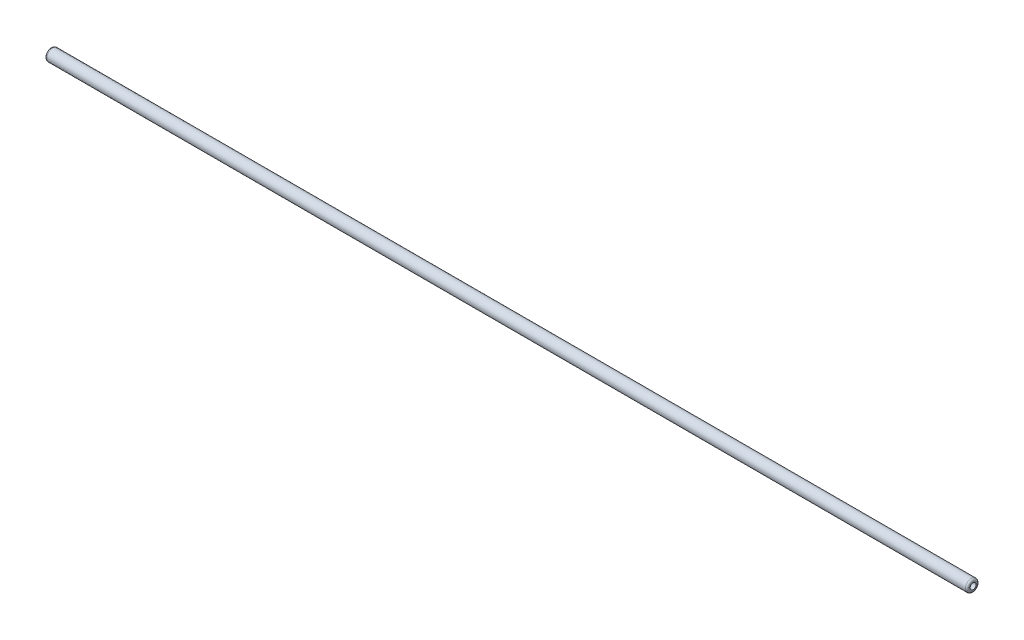
ISO-10303-21;
HEADER;
FILE_DESCRIPTION(('STEP AP214'),'2;1');
FILE_NAME('part.step','',(''),(''),'','','');
FILE_SCHEMA(('AUTOMOTIVE_DESIGN { 1 0 10303 214 1 1 1 1 }'));
ENDSEC;
DATA;
#1=APPLICATION_CONTEXT('core data for automotive mechanical design processes');
#2=APPLICATION_PROTOCOL_DEFINITION('international standard','automotive_design',2000,#1);
#3=PRODUCT_CONTEXT('',#1,'mechanical');
#4=PRODUCT('Part','Part','',(#3));
#5=PRODUCT_RELATED_PRODUCT_CATEGORY('part','',(#4));
#6=PRODUCT_DEFINITION_FORMATION('','',#4);
#7=PRODUCT_DEFINITION_CONTEXT('part definition',#1,'design');
#8=PRODUCT_DEFINITION('design','',#6,#7);
#9=PRODUCT_DEFINITION_SHAPE('','',#8);
#10=(LENGTH_UNIT() NAMED_UNIT(*) SI_UNIT(.MILLI.,.METRE.));
#11=(NAMED_UNIT(*) PLANE_ANGLE_UNIT() SI_UNIT($,.RADIAN.));
#12=(NAMED_UNIT(*) SI_UNIT($,.STERADIAN.) SOLID_ANGLE_UNIT());
#13=UNCERTAINTY_MEASURE_WITH_UNIT(LENGTH_MEASURE(1.E-05),#10,'distance_accuracy_value','');
#14=(GEOMETRIC_REPRESENTATION_CONTEXT(3) GLOBAL_UNCERTAINTY_ASSIGNED_CONTEXT((#13)) GLOBAL_UNIT_ASSIGNED_CONTEXT((#10,
#11,#12)) REPRESENTATION_CONTEXT('',''));
#15=CARTESIAN_POINT('',(0.,0.,0.));
#16=DIRECTION('',(0.,0.,1.));
#17=DIRECTION('',(1.,0.,0.));
#18=AXIS2_PLACEMENT_3D('',#15,#16,#17);
#19=CARTESIAN_POINT('',(-614.3625,-1.13464759619181E-09,0.));
#20=DIRECTION('',(-1.,-1.84686987925176E-12,0.));
#21=DIRECTION('',(0.,0.,1.));
#22=AXIS2_PLACEMENT_3D('',#19,#20,#21);
#23=PLANE('',#22);
#24=CARTESIAN_POINT('',(-614.3625,-1.13464759619181E-09,0.));
#25=DIRECTION('',(-1.,-1.84686987925176E-12,0.));
#26=DIRECTION('',(0.,0.,1.));
#27=AXIS2_PLACEMENT_3D('',#24,#25,#26);
#28=CIRCLE('',#27,5.4375);
#29=CARTESIAN_POINT('',(-614.3625,-1.13464759619181E-09,5.4375));
#30=VERTEX_POINT('',#29);
#31=EDGE_CURVE('E10',#30,#30,#28,.T.);
#32=ORIENTED_EDGE('',*,*,#31,.T.);
#33=EDGE_LOOP('',(#32));
#34=FACE_BOUND('',#33,.T.);
#35=CARTESIAN_POINT('',(-614.3625,-1.13464759619181E-09,0.));
#36=DIRECTION('',(-1.,-1.84686987925176E-12,0.));
#37=DIRECTION('',(0.,0.,1.));
#38=AXIS2_PLACEMENT_3D('',#35,#36,#37);
#39=CIRCLE('',#38,3.975);
#40=CARTESIAN_POINT('',(-614.3625,-1.13464759619181E-09,3.975));
#41=VERTEX_POINT('',#40);
#42=EDGE_CURVE('E66',#41,#41,#39,.T.);
#43=ORIENTED_EDGE('',*,*,#42,.F.);
#44=EDGE_LOOP('',(#43));
#45=FACE_BOUND('',#44,.T.);
#46=ADVANCED_FACE('F42',(#34,#45),#23,.T.);
#47=CARTESIAN_POINT('',(614.3625,1.13464759619181E-09,0.));
#48=DIRECTION('',(-1.,-1.84686987925176E-12,0.));
#49=DIRECTION('',(0.,0.,1.));
#50=AXIS2_PLACEMENT_3D('',#47,#48,#49);
#51=PLANE('',#50);
#52=CARTESIAN_POINT('',(614.3625,1.13464759619181E-09,0.));
#53=DIRECTION('',(-1.,-1.84686987925176E-12,0.));
#54=DIRECTION('',(0.,0.,1.));
#55=AXIS2_PLACEMENT_3D('',#52,#53,#54);
#56=CIRCLE('',#55,5.4375);
#57=CARTESIAN_POINT('',(614.3625,1.13464759619181E-09,5.4375));
#58=VERTEX_POINT('',#57);
#59=EDGE_CURVE('E50',#58,#58,#56,.F.);
#60=ORIENTED_EDGE('',*,*,#59,.T.);
#61=EDGE_LOOP('',(#60));
#62=FACE_BOUND('',#61,.T.);
#63=CARTESIAN_POINT('',(614.3625,1.13464759619181E-09,0.));
#64=DIRECTION('',(-1.,-1.84686987925176E-12,0.));
#65=DIRECTION('',(0.,0.,1.));
#66=AXIS2_PLACEMENT_3D('',#63,#64,#65);
#67=CIRCLE('',#66,3.975);
#68=CARTESIAN_POINT('',(614.3625,1.13464759619181E-09,3.975));
#69=VERTEX_POINT('',#68);
#70=EDGE_CURVE('E67',#69,#69,#67,.T.);
#71=ORIENTED_EDGE('',*,*,#70,.T.);
#72=EDGE_LOOP('',(#71));
#73=FACE_BOUND('',#72,.T.);
#74=ADVANCED_FACE('F79',(#62,#73),#51,.F.);
#75=CARTESIAN_POINT('',(-614.3625,-1.13464759619181E-09,0.));
#76=DIRECTION('',(1.,1.84686987925176E-12,0.));
#77=DIRECTION('',(0.,0.,-1.));
#78=AXIS2_PLACEMENT_3D('',#75,#76,#77);
#79=CYLINDRICAL_SURFACE('',#78,7.9375);
#80=CARTESIAN_POINT('',(611.8625,1.13003042149368E-09,0.));
#81=DIRECTION('',(-1.,-1.84686987925176E-12,0.));
#82=DIRECTION('',(0.,0.,1.));
#83=AXIS2_PLACEMENT_3D('',#80,#81,#82);
#84=CIRCLE('',#83,7.9375);
#85=CARTESIAN_POINT('',(611.8625,1.13003042149368E-09,7.9375));
#86=VERTEX_POINT('',#85);
#87=EDGE_CURVE('E55',#86,#86,#84,.T.);
#88=ORIENTED_EDGE('',*,*,#87,.T.);
#89=EDGE_LOOP('',(#88));
#90=FACE_BOUND('',#89,.T.);
#91=CARTESIAN_POINT('',(-611.8625,-1.13003042149368E-09,0.));
#92=DIRECTION('',(-1.,-1.84686987925176E-12,0.));
#93=DIRECTION('',(0.,0.,1.));
#94=AXIS2_PLACEMENT_3D('',#91,#92,#93);
#95=CIRCLE('',#94,7.9375);
#96=CARTESIAN_POINT('',(-611.8625,-1.13003042149368E-09,7.9375));
#97=VERTEX_POINT('',#96);
#98=EDGE_CURVE('E60',#97,#97,#95,.F.);
#99=ORIENTED_EDGE('',*,*,#98,.T.);
#100=EDGE_LOOP('',(#99));
#101=FACE_BOUND('',#100,.T.);
#102=ADVANCED_FACE('F84',(#90,#101),#79,.T.);
#103=CARTESIAN_POINT('',(-614.3625,-1.13464759619181E-09,0.));
#104=DIRECTION('',(1.,1.84686987925176E-12,0.));
#105=DIRECTION('',(0.,0.,-1.));
#106=AXIS2_PLACEMENT_3D('',#103,#104,#105);
#107=CYLINDRICAL_SURFACE('',#106,3.975);
#108=ORIENTED_EDGE('',*,*,#42,.T.);
#109=EDGE_LOOP('',(#108));
#110=FACE_BOUND('',#109,.T.);
#111=ORIENTED_EDGE('',*,*,#70,.F.);
#112=EDGE_LOOP('',(#111));
#113=FACE_BOUND('',#112,.T.);
#114=ADVANCED_FACE('F75',(#110,#113),#107,.F.);
#115=CARTESIAN_POINT('',(611.8625,1.13003042149368E-09,0.));
#116=DIRECTION('',(-1.,-1.84686987925176E-12,0.));
#117=DIRECTION('',(0.,0.,1.));
#118=AXIS2_PLACEMENT_3D('',#115,#116,#117);
#119=TOROIDAL_SURFACE('',#118,5.4375,2.5);
#120=ORIENTED_EDGE('',*,*,#59,.F.);
#121=EDGE_LOOP('',(#120));
#122=FACE_BOUND('',#121,.T.);
#123=ORIENTED_EDGE('',*,*,#87,.F.);
#124=EDGE_LOOP('',(#123));
#125=FACE_BOUND('',#124,.T.);
#126=ADVANCED_FACE('F90',(#122,#125),#119,.T.);
#127=CARTESIAN_POINT('',(-611.8625,-1.13003042149368E-09,0.));
#128=DIRECTION('',(-1.,-1.84686987925176E-12,0.));
#129=DIRECTION('',(0.,0.,1.));
#130=AXIS2_PLACEMENT_3D('',#127,#128,#129);
#131=TOROIDAL_SURFACE('',#130,5.4375,2.5);
#132=ORIENTED_EDGE('',*,*,#98,.F.);
#133=EDGE_LOOP('',(#132));
#134=FACE_BOUND('',#133,.T.);
#135=ORIENTED_EDGE('',*,*,#31,.F.);
#136=EDGE_LOOP('',(#135));
#137=FACE_BOUND('',#136,.T.);
#138=ADVANCED_FACE('F44',(#134,#137),#131,.T.);
#139=CLOSED_SHELL('',(#46,#74,#102,#114,#126,#138));
#140=MANIFOLD_SOLID_BREP('B2',#139);
#141=ADVANCED_BREP_SHAPE_REPRESENTATION('',(#18,#140),#14);
#142=SHAPE_DEFINITION_REPRESENTATION(#9,#141);
ENDSEC;
END-ISO-10303-21;
